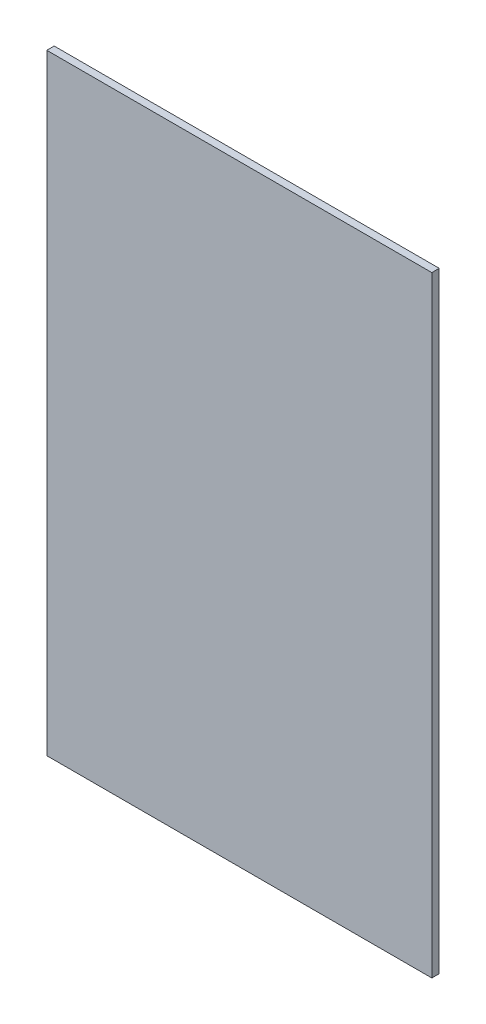
ISO-10303-21;
HEADER;
FILE_DESCRIPTION(('STEP AP214'),'2;1');
FILE_NAME('part.step','',(''),(''),'','','');
FILE_SCHEMA(('AUTOMOTIVE_DESIGN { 1 0 10303 214 1 1 1 1 }'));
ENDSEC;
DATA;
#1=APPLICATION_CONTEXT('core data for automotive mechanical design processes');
#2=APPLICATION_PROTOCOL_DEFINITION('international standard','automotive_design',2000,#1);
#3=PRODUCT_CONTEXT('',#1,'mechanical');
#4=PRODUCT('Part','Part','',(#3));
#5=PRODUCT_RELATED_PRODUCT_CATEGORY('part','',(#4));
#6=PRODUCT_DEFINITION_FORMATION('','',#4);
#7=PRODUCT_DEFINITION_CONTEXT('part definition',#1,'design');
#8=PRODUCT_DEFINITION('design','',#6,#7);
#9=PRODUCT_DEFINITION_SHAPE('','',#8);
#10=(LENGTH_UNIT() NAMED_UNIT(*) SI_UNIT(.MILLI.,.METRE.));
#11=(NAMED_UNIT(*) PLANE_ANGLE_UNIT() SI_UNIT($,.RADIAN.));
#12=(NAMED_UNIT(*) SI_UNIT($,.STERADIAN.) SOLID_ANGLE_UNIT());
#13=UNCERTAINTY_MEASURE_WITH_UNIT(LENGTH_MEASURE(1.E-05),#10,'distance_accuracy_value','');
#14=(GEOMETRIC_REPRESENTATION_CONTEXT(3) GLOBAL_UNCERTAINTY_ASSIGNED_CONTEXT((#13)) GLOBAL_UNIT_ASSIGNED_CONTEXT((#10,
#11,#12)) REPRESENTATION_CONTEXT('',''));
#15=CARTESIAN_POINT('',(0.,0.,0.));
#16=DIRECTION('',(0.,0.,1.));
#17=DIRECTION('',(1.,0.,0.));
#18=AXIS2_PLACEMENT_3D('',#15,#16,#17);
#19=CARTESIAN_POINT('',(-660.4,835.025,82.55));
#20=DIRECTION('',(1.,0.,0.));
#21=DIRECTION('',(0.,1.,0.));
#22=AXIS2_PLACEMENT_3D('',#19,#20,#21);
#23=PLANE('',#22);
#24=DIRECTION('',(0.,1.,0.));
#25=VECTOR('',#24,1.);
#26=CARTESIAN_POINT('',(-660.4,660.4,88.9));
#27=LINE('',#26,#25);
#28=CARTESIAN_POINT('',(-660.4,323.85,88.9));
#29=VERTEX_POINT('',#28);
#30=CARTESIAN_POINT('',(-660.4,1371.6,88.9));
#31=VERTEX_POINT('',#30);
#32=EDGE_CURVE('E81',#29,#31,#27,.T.);
#33=ORIENTED_EDGE('',*,*,#32,.F.);
#34=DIRECTION('',(0.,0.,-1.));
#35=VECTOR('',#34,1.);
#36=CARTESIAN_POINT('',(-660.4,323.85,88.902));
#37=LINE('',#36,#35);
#38=CARTESIAN_POINT('',(-660.4,323.85,76.2));
#39=VERTEX_POINT('',#38);
#40=EDGE_CURVE('E85',#29,#39,#37,.T.);
#41=ORIENTED_EDGE('',*,*,#40,.T.);
#42=DIRECTION('',(0.,1.,0.));
#43=VECTOR('',#42,1.);
#44=CARTESIAN_POINT('',(-660.4,847.725,76.2));
#45=LINE('',#44,#43);
#46=CARTESIAN_POINT('',(-660.4,1371.6,76.2));
#47=VERTEX_POINT('',#46);
#48=EDGE_CURVE('E90',#39,#47,#45,.T.);
#49=ORIENTED_EDGE('',*,*,#48,.T.);
#50=DIRECTION('',(0.,0.,1.));
#51=VECTOR('',#50,1.);
#52=CARTESIAN_POINT('',(-660.4,1371.6,88.902));
#53=LINE('',#52,#51);
#54=EDGE_CURVE('E74',#47,#31,#53,.T.);
#55=ORIENTED_EDGE('',*,*,#54,.T.);
#56=EDGE_LOOP('',(#33,#41,#49,#55));
#57=FACE_BOUND('',#56,.T.);
#58=ADVANCED_FACE('F14',(#57),#23,.T.);
#59=CARTESIAN_POINT('',(-1320.8,847.725,88.902));
#60=DIRECTION('',(1.,0.,0.));
#61=DIRECTION('',(0.,1.,0.));
#62=AXIS2_PLACEMENT_3D('',#59,#60,#61);
#63=PLANE('',#62);
#64=DIRECTION('',(0.,-1.,0.));
#65=VECTOR('',#64,1.);
#66=CARTESIAN_POINT('',(-1320.8,847.725,88.9));
#67=LINE('',#66,#65);
#68=CARTESIAN_POINT('',(-1320.8,1371.6,88.9));
#69=VERTEX_POINT('',#68);
#70=CARTESIAN_POINT('',(-1320.8,323.85,88.9));
#71=VERTEX_POINT('',#70);
#72=EDGE_CURVE('E9',#69,#71,#67,.T.);
#73=ORIENTED_EDGE('',*,*,#72,.F.);
#74=DIRECTION('',(0.,0.,-1.));
#75=VECTOR('',#74,1.);
#76=CARTESIAN_POINT('',(-1320.8,1371.6,88.902));
#77=LINE('',#76,#75);
#78=CARTESIAN_POINT('',(-1320.8,1371.6,76.2));
#79=VERTEX_POINT('',#78);
#80=EDGE_CURVE('E102',#69,#79,#77,.T.);
#81=ORIENTED_EDGE('',*,*,#80,.T.);
#82=DIRECTION('',(0.,-1.,0.));
#83=VECTOR('',#82,1.);
#84=CARTESIAN_POINT('',(-1320.8,847.725,76.2));
#85=LINE('',#84,#83);
#86=CARTESIAN_POINT('',(-1320.8,323.85,76.2));
#87=VERTEX_POINT('',#86);
#88=EDGE_CURVE('E100',#79,#87,#85,.T.);
#89=ORIENTED_EDGE('',*,*,#88,.T.);
#90=DIRECTION('',(0.,0.,-1.));
#91=VECTOR('',#90,1.);
#92=CARTESIAN_POINT('',(-1320.8,323.85,88.902));
#93=LINE('',#92,#91);
#94=EDGE_CURVE('E53',#71,#87,#93,.T.);
#95=ORIENTED_EDGE('',*,*,#94,.F.);
#96=EDGE_LOOP('',(#73,#81,#89,#95));
#97=FACE_BOUND('',#96,.T.);
#98=ADVANCED_FACE('F118',(#97),#63,.F.);
#99=CARTESIAN_POINT('',(-660.4,323.85,88.902));
#100=DIRECTION('',(0.,1.,0.));
#101=DIRECTION('',(0.,0.,1.));
#102=AXIS2_PLACEMENT_3D('',#99,#100,#101);
#103=PLANE('',#102);
#104=ORIENTED_EDGE('',*,*,#40,.F.);
#105=DIRECTION('',(1.,0.,0.));
#106=VECTOR('',#105,1.);
#107=CARTESIAN_POINT('',(-660.4,323.85,88.9));
#108=LINE('',#107,#106);
#109=EDGE_CURVE('E17',#71,#29,#108,.T.);
#110=ORIENTED_EDGE('',*,*,#109,.F.);
#111=ORIENTED_EDGE('',*,*,#94,.T.);
#112=DIRECTION('',(1.,0.,0.));
#113=VECTOR('',#112,1.);
#114=CARTESIAN_POINT('',(-660.4,323.85,76.2));
#115=LINE('',#114,#113);
#116=EDGE_CURVE('E64',#87,#39,#115,.T.);
#117=ORIENTED_EDGE('',*,*,#116,.T.);
#118=EDGE_LOOP('',(#104,#110,#111,#117));
#119=FACE_BOUND('',#118,.T.);
#120=ADVANCED_FACE('F86',(#119),#103,.F.);
#121=CARTESIAN_POINT('',(-660.4,847.725,76.2));
#122=DIRECTION('',(0.,0.,1.));
#123=DIRECTION('',(1.,0.,0.));
#124=AXIS2_PLACEMENT_3D('',#121,#122,#123);
#125=PLANE('',#124);
#126=ORIENTED_EDGE('',*,*,#48,.F.);
#127=ORIENTED_EDGE('',*,*,#116,.F.);
#128=ORIENTED_EDGE('',*,*,#88,.F.);
#129=DIRECTION('',(-1.,0.,0.));
#130=VECTOR('',#129,1.);
#131=CARTESIAN_POINT('',(-796.925,1371.6,76.2));
#132=LINE('',#131,#130);
#133=EDGE_CURVE('E83',#47,#79,#132,.T.);
#134=ORIENTED_EDGE('',*,*,#133,.F.);
#135=EDGE_LOOP('',(#126,#127,#128,#134));
#136=FACE_BOUND('',#135,.T.);
#137=ADVANCED_FACE('F120',(#136),#125,.F.);
#138=CARTESIAN_POINT('',(-796.925,1371.6,88.902));
#139=DIRECTION('',(0.,-1.,0.));
#140=DIRECTION('',(0.,0.,-1.));
#141=AXIS2_PLACEMENT_3D('',#138,#139,#140);
#142=PLANE('',#141);
#143=ORIENTED_EDGE('',*,*,#54,.F.);
#144=ORIENTED_EDGE('',*,*,#133,.T.);
#145=ORIENTED_EDGE('',*,*,#80,.F.);
#146=DIRECTION('',(-1.,0.,0.));
#147=VECTOR('',#146,1.);
#148=CARTESIAN_POINT('',(-796.925,1371.6,88.9));
#149=LINE('',#148,#147);
#150=EDGE_CURVE('E24',#31,#69,#149,.T.);
#151=ORIENTED_EDGE('',*,*,#150,.F.);
#152=EDGE_LOOP('',(#143,#144,#145,#151));
#153=FACE_BOUND('',#152,.T.);
#154=ADVANCED_FACE('F121',(#153),#142,.F.);
#155=CARTESIAN_POINT('',(2.22044604925032E-13,660.4,88.9));
#156=DIRECTION('',(0.,0.,1.));
#157=DIRECTION('',(1.,0.,0.));
#158=AXIS2_PLACEMENT_3D('',#155,#156,#157);
#159=PLANE('',#158);
#160=ORIENTED_EDGE('',*,*,#109,.T.);
#161=ORIENTED_EDGE('',*,*,#32,.T.);
#162=ORIENTED_EDGE('',*,*,#150,.T.);
#163=ORIENTED_EDGE('',*,*,#72,.T.);
#164=EDGE_LOOP('',(#160,#161,#162,#163));
#165=FACE_BOUND('',#164,.T.);
#166=ADVANCED_FACE('F79',(#165),#159,.T.);
#167=CLOSED_SHELL('',(#58,#98,#120,#137,#154,#166));
#168=MANIFOLD_SOLID_BREP('B1',#167);
#169=ADVANCED_BREP_SHAPE_REPRESENTATION('',(#18,#168),#14);
#170=SHAPE_DEFINITION_REPRESENTATION(#9,#169);
ENDSEC;
END-ISO-10303-21;
